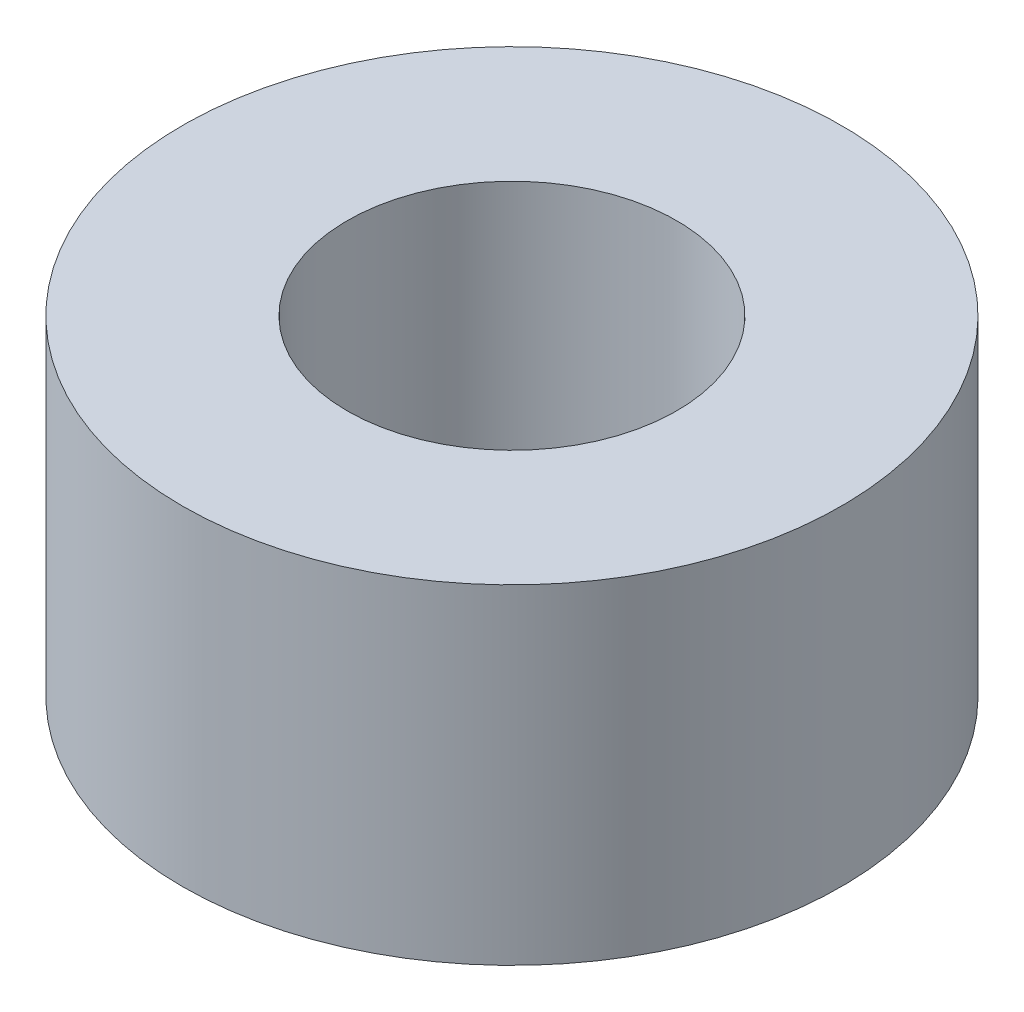
ISO-10303-21;
HEADER;
FILE_DESCRIPTION(('STEP AP214'),'2;1');
FILE_NAME('part.step','',(''),(''),'','','');
FILE_SCHEMA(('AUTOMOTIVE_DESIGN { 1 0 10303 214 1 1 1 1 }'));
ENDSEC;
DATA;
#1=APPLICATION_CONTEXT('core data for automotive mechanical design processes');
#2=APPLICATION_PROTOCOL_DEFINITION('international standard','automotive_design',2000,#1);
#3=PRODUCT_CONTEXT('',#1,'mechanical');
#4=PRODUCT('Part','Part','',(#3));
#5=PRODUCT_RELATED_PRODUCT_CATEGORY('part','',(#4));
#6=PRODUCT_DEFINITION_FORMATION('','',#4);
#7=PRODUCT_DEFINITION_CONTEXT('part definition',#1,'design');
#8=PRODUCT_DEFINITION('design','',#6,#7);
#9=PRODUCT_DEFINITION_SHAPE('','',#8);
#10=(LENGTH_UNIT() NAMED_UNIT(*) SI_UNIT(.MILLI.,.METRE.));
#11=(NAMED_UNIT(*) PLANE_ANGLE_UNIT() SI_UNIT($,.RADIAN.));
#12=(NAMED_UNIT(*) SI_UNIT($,.STERADIAN.) SOLID_ANGLE_UNIT());
#13=UNCERTAINTY_MEASURE_WITH_UNIT(LENGTH_MEASURE(1.E-05),#10,'distance_accuracy_value','');
#14=(GEOMETRIC_REPRESENTATION_CONTEXT(3) GLOBAL_UNCERTAINTY_ASSIGNED_CONTEXT((#13)) GLOBAL_UNIT_ASSIGNED_CONTEXT((#10,
#11,#12)) REPRESENTATION_CONTEXT('',''));
#15=CARTESIAN_POINT('',(0.,0.,0.));
#16=DIRECTION('',(0.,0.,1.));
#17=DIRECTION('',(1.,0.,0.));
#18=AXIS2_PLACEMENT_3D('',#15,#16,#17);
#19=CARTESIAN_POINT('',(0.,3.175,0.));
#20=DIRECTION('',(0.,1.,0.));
#21=DIRECTION('',(0.,0.,1.));
#22=AXIS2_PLACEMENT_3D('',#19,#20,#21);
#23=PLANE('',#22);
#24=CARTESIAN_POINT('',(0.,3.175,0.));
#25=DIRECTION('',(0.,1.,0.));
#26=DIRECTION('',(0.,0.,1.));
#27=AXIS2_PLACEMENT_3D('',#24,#25,#26);
#28=CIRCLE('',#27,3.175);
#29=CARTESIAN_POINT('',(0.,3.175,3.175));
#30=VERTEX_POINT('',#29);
#31=EDGE_CURVE('E10',#30,#30,#28,.T.);
#32=ORIENTED_EDGE('',*,*,#31,.T.);
#33=EDGE_LOOP('',(#32));
#34=FACE_BOUND('',#33,.T.);
#35=CARTESIAN_POINT('',(0.,3.175,0.));
#36=DIRECTION('',(0.,1.,0.));
#37=DIRECTION('',(0.,0.,1.));
#38=AXIS2_PLACEMENT_3D('',#35,#36,#37);
#39=CIRCLE('',#38,1.5875);
#40=CARTESIAN_POINT('',(0.,3.175,1.5875));
#41=VERTEX_POINT('',#40);
#42=EDGE_CURVE('E44',#41,#41,#39,.T.);
#43=ORIENTED_EDGE('',*,*,#42,.F.);
#44=EDGE_LOOP('',(#43));
#45=FACE_BOUND('',#44,.T.);
#46=ADVANCED_FACE('F33',(#34,#45),#23,.T.);
#47=CARTESIAN_POINT('',(0.,0.,0.));
#48=DIRECTION('',(0.,1.,0.));
#49=DIRECTION('',(0.,0.,1.));
#50=AXIS2_PLACEMENT_3D('',#47,#48,#49);
#51=PLANE('',#50);
#52=CARTESIAN_POINT('',(0.,0.,0.));
#53=DIRECTION('',(0.,1.,0.));
#54=DIRECTION('',(0.,0.,1.));
#55=AXIS2_PLACEMENT_3D('',#52,#53,#54);
#56=CIRCLE('',#55,3.175);
#57=CARTESIAN_POINT('',(0.,0.,3.175));
#58=VERTEX_POINT('',#57);
#59=EDGE_CURVE('E37',#58,#58,#56,.T.);
#60=ORIENTED_EDGE('',*,*,#59,.F.);
#61=EDGE_LOOP('',(#60));
#62=FACE_BOUND('',#61,.T.);
#63=CARTESIAN_POINT('',(0.,0.,0.));
#64=DIRECTION('',(0.,1.,0.));
#65=DIRECTION('',(0.,0.,1.));
#66=AXIS2_PLACEMENT_3D('',#63,#64,#65);
#67=CIRCLE('',#66,1.5875);
#68=CARTESIAN_POINT('',(0.,0.,1.5875));
#69=VERTEX_POINT('',#68);
#70=EDGE_CURVE('E46',#69,#69,#67,.T.);
#71=ORIENTED_EDGE('',*,*,#70,.T.);
#72=EDGE_LOOP('',(#71));
#73=FACE_BOUND('',#72,.T.);
#74=ADVANCED_FACE('F56',(#62,#73),#51,.F.);
#75=CARTESIAN_POINT('',(0.,3.175,0.));
#76=DIRECTION('',(0.,-1.,0.));
#77=DIRECTION('',(0.,0.,-1.));
#78=AXIS2_PLACEMENT_3D('',#75,#76,#77);
#79=CYLINDRICAL_SURFACE('',#78,3.175);
#80=ORIENTED_EDGE('',*,*,#31,.F.);
#81=EDGE_LOOP('',(#80));
#82=FACE_BOUND('',#81,.T.);
#83=ORIENTED_EDGE('',*,*,#59,.T.);
#84=EDGE_LOOP('',(#83));
#85=FACE_BOUND('',#84,.T.);
#86=ADVANCED_FACE('F35',(#82,#85),#79,.T.);
#87=CARTESIAN_POINT('',(0.,3.175,0.));
#88=DIRECTION('',(0.,-1.,0.));
#89=DIRECTION('',(0.,0.,-1.));
#90=AXIS2_PLACEMENT_3D('',#87,#88,#89);
#91=CYLINDRICAL_SURFACE('',#90,1.5875);
#92=ORIENTED_EDGE('',*,*,#42,.T.);
#93=EDGE_LOOP('',(#92));
#94=FACE_BOUND('',#93,.T.);
#95=ORIENTED_EDGE('',*,*,#70,.F.);
#96=EDGE_LOOP('',(#95));
#97=FACE_BOUND('',#96,.T.);
#98=ADVANCED_FACE('F52',(#94,#97),#91,.F.);
#99=CLOSED_SHELL('',(#46,#74,#86,#98));
#100=MANIFOLD_SOLID_BREP('B2',#99);
#101=ADVANCED_BREP_SHAPE_REPRESENTATION('',(#18,#100),#14);
#102=SHAPE_DEFINITION_REPRESENTATION(#9,#101);
ENDSEC;
END-ISO-10303-21;
